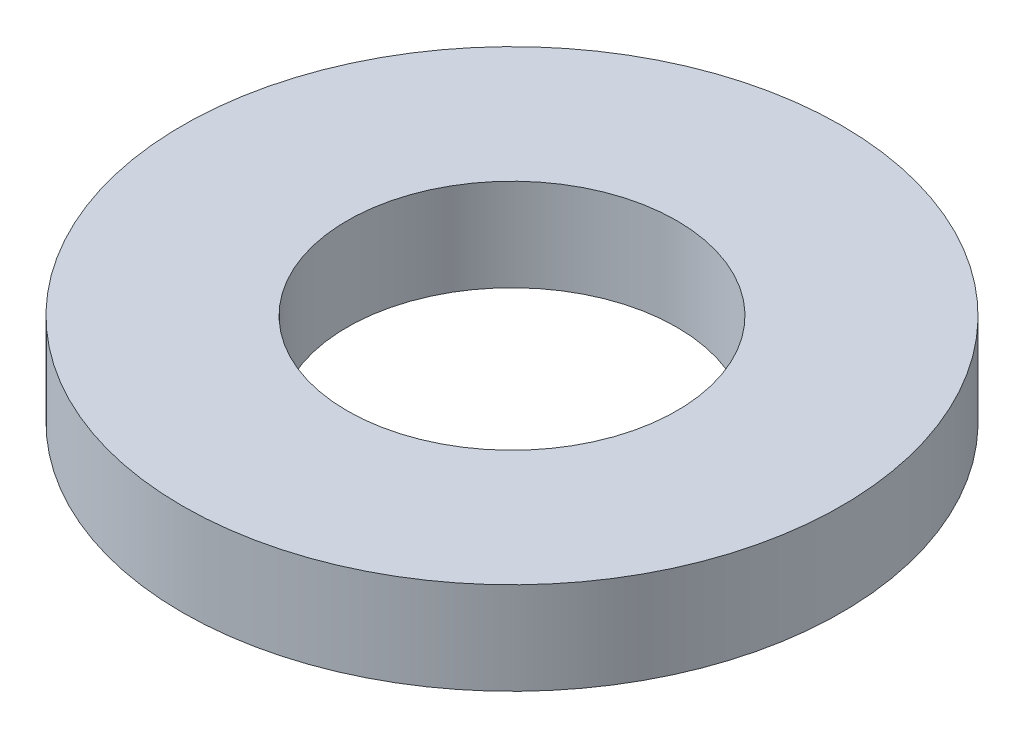
ISO-10303-21;
HEADER;
FILE_DESCRIPTION(('STEP AP214'),'2;1');
FILE_NAME('part.step','',(''),(''),'','','');
FILE_SCHEMA(('AUTOMOTIVE_DESIGN { 1 0 10303 214 1 1 1 1 }'));
ENDSEC;
DATA;
#1=APPLICATION_CONTEXT('core data for automotive mechanical design processes');
#2=APPLICATION_PROTOCOL_DEFINITION('international standard','automotive_design',2000,#1);
#3=PRODUCT_CONTEXT('',#1,'mechanical');
#4=PRODUCT('Part','Part','',(#3));
#5=PRODUCT_RELATED_PRODUCT_CATEGORY('part','',(#4));
#6=PRODUCT_DEFINITION_FORMATION('','',#4);
#7=PRODUCT_DEFINITION_CONTEXT('part definition',#1,'design');
#8=PRODUCT_DEFINITION('design','',#6,#7);
#9=PRODUCT_DEFINITION_SHAPE('','',#8);
#10=(LENGTH_UNIT() NAMED_UNIT(*) SI_UNIT(.MILLI.,.METRE.));
#11=(NAMED_UNIT(*) PLANE_ANGLE_UNIT() SI_UNIT($,.RADIAN.));
#12=(NAMED_UNIT(*) SI_UNIT($,.STERADIAN.) SOLID_ANGLE_UNIT());
#13=UNCERTAINTY_MEASURE_WITH_UNIT(LENGTH_MEASURE(1.E-05),#10,'distance_accuracy_value','');
#14=(GEOMETRIC_REPRESENTATION_CONTEXT(3) GLOBAL_UNCERTAINTY_ASSIGNED_CONTEXT((#13)) GLOBAL_UNIT_ASSIGNED_CONTEXT((#10,
#11,#12)) REPRESENTATION_CONTEXT('',''));
#15=CARTESIAN_POINT('',(0.,0.,0.));
#16=DIRECTION('',(0.,0.,1.));
#17=DIRECTION('',(1.,0.,0.));
#18=AXIS2_PLACEMENT_3D('',#15,#16,#17);
#19=CARTESIAN_POINT('',(0.,28.,0.));
#20=DIRECTION('',(0.,-1.,0.));
#21=DIRECTION('',(0.,0.,-1.));
#22=AXIS2_PLACEMENT_3D('',#19,#20,#21);
#23=CYLINDRICAL_SURFACE('',#22,100.);
#24=CARTESIAN_POINT('',(0.,28.,0.));
#25=DIRECTION('',(0.,1.,0.));
#26=DIRECTION('',(0.,0.,1.));
#27=AXIS2_PLACEMENT_3D('',#24,#25,#26);
#28=CIRCLE('',#27,100.);
#29=CARTESIAN_POINT('',(0.,28.,100.));
#30=VERTEX_POINT('',#29);
#31=EDGE_CURVE('E10',#30,#30,#28,.T.);
#32=ORIENTED_EDGE('',*,*,#31,.F.);
#33=EDGE_LOOP('',(#32));
#34=FACE_BOUND('',#33,.T.);
#35=CARTESIAN_POINT('',(0.,0.,0.));
#36=DIRECTION('',(0.,1.,0.));
#37=DIRECTION('',(0.,0.,1.));
#38=AXIS2_PLACEMENT_3D('',#35,#36,#37);
#39=CIRCLE('',#38,100.);
#40=CARTESIAN_POINT('',(0.,0.,100.));
#41=VERTEX_POINT('',#40);
#42=EDGE_CURVE('E37',#41,#41,#39,.T.);
#43=ORIENTED_EDGE('',*,*,#42,.T.);
#44=EDGE_LOOP('',(#43));
#45=FACE_BOUND('',#44,.T.);
#46=ADVANCED_FACE('F40',(#34,#45),#23,.T.);
#47=CARTESIAN_POINT('',(0.,28.,0.));
#48=DIRECTION('',(0.,1.,0.));
#49=DIRECTION('',(0.,0.,1.));
#50=AXIS2_PLACEMENT_3D('',#47,#48,#49);
#51=PLANE('',#50);
#52=CARTESIAN_POINT('',(0.,28.,0.));
#53=DIRECTION('',(0.,1.,0.));
#54=DIRECTION('',(0.,0.,1.));
#55=AXIS2_PLACEMENT_3D('',#52,#53,#54);
#56=CIRCLE('',#55,50.);
#57=CARTESIAN_POINT('',(0.,28.,50.));
#58=VERTEX_POINT('',#57);
#59=EDGE_CURVE('E50',#58,#58,#56,.T.);
#60=ORIENTED_EDGE('',*,*,#59,.F.);
#61=EDGE_LOOP('',(#60));
#62=FACE_BOUND('',#61,.T.);
#63=ORIENTED_EDGE('',*,*,#31,.T.);
#64=EDGE_LOOP('',(#63));
#65=FACE_BOUND('',#64,.T.);
#66=ADVANCED_FACE('F59',(#62,#65),#51,.T.);
#67=CARTESIAN_POINT('',(0.,0.,0.));
#68=DIRECTION('',(0.,1.,0.));
#69=DIRECTION('',(0.,0.,1.));
#70=AXIS2_PLACEMENT_3D('',#67,#68,#69);
#71=PLANE('',#70);
#72=CARTESIAN_POINT('',(0.,0.,0.));
#73=DIRECTION('',(0.,1.,0.));
#74=DIRECTION('',(0.,0.,1.));
#75=AXIS2_PLACEMENT_3D('',#72,#73,#74);
#76=CIRCLE('',#75,50.);
#77=CARTESIAN_POINT('',(0.,0.,50.));
#78=VERTEX_POINT('',#77);
#79=EDGE_CURVE('E47',#78,#78,#76,.T.);
#80=ORIENTED_EDGE('',*,*,#79,.T.);
#81=EDGE_LOOP('',(#80));
#82=FACE_BOUND('',#81,.T.);
#83=ORIENTED_EDGE('',*,*,#42,.F.);
#84=EDGE_LOOP('',(#83));
#85=FACE_BOUND('',#84,.T.);
#86=ADVANCED_FACE('F58',(#82,#85),#71,.F.);
#87=CARTESIAN_POINT('',(0.,28.,0.));
#88=DIRECTION('',(0.,-1.,0.));
#89=DIRECTION('',(0.,0.,-1.));
#90=AXIS2_PLACEMENT_3D('',#87,#88,#89);
#91=CYLINDRICAL_SURFACE('',#90,50.);
#92=ORIENTED_EDGE('',*,*,#59,.T.);
#93=EDGE_LOOP('',(#92));
#94=FACE_BOUND('',#93,.T.);
#95=ORIENTED_EDGE('',*,*,#79,.F.);
#96=EDGE_LOOP('',(#95));
#97=FACE_BOUND('',#96,.T.);
#98=ADVANCED_FACE('F54',(#94,#97),#91,.F.);
#99=CLOSED_SHELL('',(#46,#66,#86,#98));
#100=MANIFOLD_SOLID_BREP('B2',#99);
#101=ADVANCED_BREP_SHAPE_REPRESENTATION('',(#18,#100),#14);
#102=SHAPE_DEFINITION_REPRESENTATION(#9,#101);
ENDSEC;
END-ISO-10303-21;
